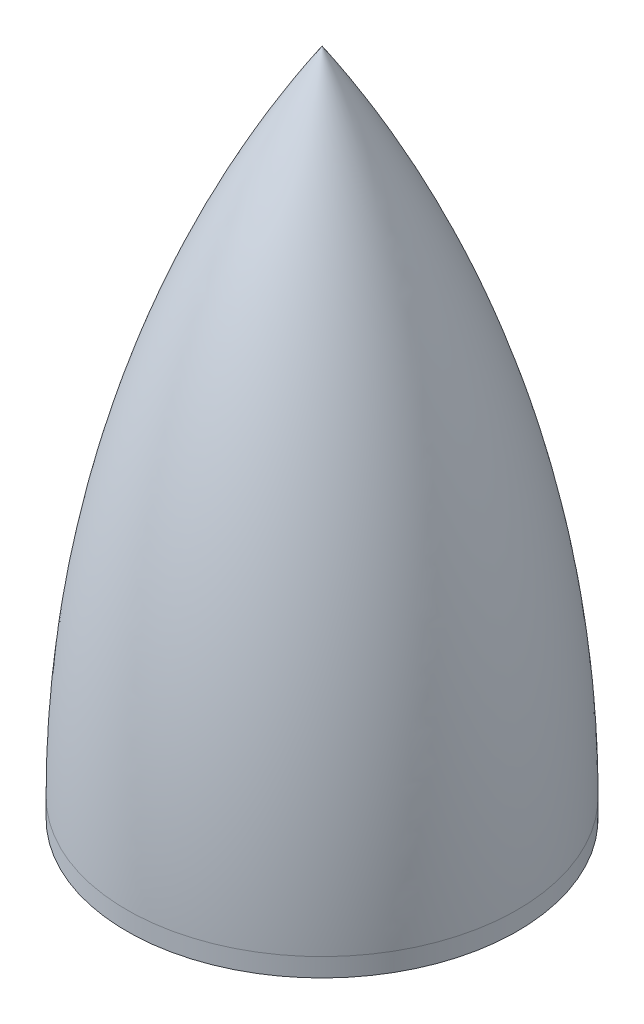
ISO-10303-21;
HEADER;
FILE_DESCRIPTION(('STEP AP214'),'2;1');
FILE_NAME('part.step','',(''),(''),'','','');
FILE_SCHEMA(('AUTOMOTIVE_DESIGN { 1 0 10303 214 1 1 1 1 }'));
ENDSEC;
DATA;
#1=APPLICATION_CONTEXT('core data for automotive mechanical design processes');
#2=APPLICATION_PROTOCOL_DEFINITION('international standard','automotive_design',2000,#1);
#3=PRODUCT_CONTEXT('',#1,'mechanical');
#4=PRODUCT('Part','Part','',(#3));
#5=PRODUCT_RELATED_PRODUCT_CATEGORY('part','',(#4));
#6=PRODUCT_DEFINITION_FORMATION('','',#4);
#7=PRODUCT_DEFINITION_CONTEXT('part definition',#1,'design');
#8=PRODUCT_DEFINITION('design','',#6,#7);
#9=PRODUCT_DEFINITION_SHAPE('','',#8);
#10=(LENGTH_UNIT() NAMED_UNIT(*) SI_UNIT(.MILLI.,.METRE.));
#11=(NAMED_UNIT(*) PLANE_ANGLE_UNIT() SI_UNIT($,.RADIAN.));
#12=(NAMED_UNIT(*) SI_UNIT($,.STERADIAN.) SOLID_ANGLE_UNIT());
#13=UNCERTAINTY_MEASURE_WITH_UNIT(LENGTH_MEASURE(1.E-05),#10,'distance_accuracy_value','');
#14=(GEOMETRIC_REPRESENTATION_CONTEXT(3) GLOBAL_UNCERTAINTY_ASSIGNED_CONTEXT((#13)) GLOBAL_UNIT_ASSIGNED_CONTEXT((#10,
#11,#12)) REPRESENTATION_CONTEXT('',''));
#15=CARTESIAN_POINT('',(0.,0.,0.));
#16=DIRECTION('',(0.,0.,1.));
#17=DIRECTION('',(1.,0.,0.));
#18=AXIS2_PLACEMENT_3D('',#15,#16,#17);
#19=CARTESIAN_POINT('',(0.,0.,0.));
#20=DIRECTION('',(0.,-1.,0.));
#21=DIRECTION('',(0.,0.,-1.));
#22=AXIS2_PLACEMENT_3D('',#19,#20,#21);
#23=CYLINDRICAL_SURFACE('',#22,22.225);
#24=CARTESIAN_POINT('',(0.,0.,0.));
#25=DIRECTION('',(0.,-1.,0.));
#26=DIRECTION('',(0.,0.,-1.));
#27=AXIS2_PLACEMENT_3D('',#24,#25,#26);
#28=CIRCLE('',#27,22.225);
#29=CARTESIAN_POINT('',(0.,0.,-22.225));
#30=VERTEX_POINT('',#29);
#31=EDGE_CURVE('E66',#30,#30,#28,.T.);
#32=ORIENTED_EDGE('',*,*,#31,.F.);
#33=EDGE_LOOP('',(#32));
#34=FACE_BOUND('',#33,.T.);
#35=CARTESIAN_POINT('',(0.,2.10820000000002,0.));
#36=DIRECTION('',(0.,-1.,0.));
#37=DIRECTION('',(0.,0.,-1.));
#38=AXIS2_PLACEMENT_3D('',#35,#36,#37);
#39=CIRCLE('',#38,22.225);
#40=CARTESIAN_POINT('',(0.,2.10820000000002,-22.225));
#41=VERTEX_POINT('',#40);
#42=EDGE_CURVE('E11',#41,#41,#39,.T.);
#43=ORIENTED_EDGE('',*,*,#42,.T.);
#44=EDGE_LOOP('',(#43));
#45=FACE_BOUND('',#44,.T.);
#46=ADVANCED_FACE('F31',(#34,#45),#23,.T.);
#47=CARTESIAN_POINT('',(0.,2.10820000000002,112.387946057143));
#48=DIRECTION('',(-1.,0.,0.));
#49=DIRECTION('',(0.,0.,-1.));
#50=AXIS2_PLACEMENT_3D('',#47,#48,#49);
#51=CIRCLE('',#50,134.612946057143);
#52=TRIMMED_CURVE('',#51,(PARAMETER_VALUE(-0.58285068598359)),
(PARAMETER_VALUE(0.58285068598359)),.T.,.PARAMETER.);
#53=CARTESIAN_POINT('',(0.,2.10820000000002,0.));
#54=DIRECTION('',(0.,-1.,0.));
#55=AXIS1_PLACEMENT('',#53,#54);
#56=SURFACE_OF_REVOLUTION('',#52,#55);
#57=ORIENTED_EDGE('',*,*,#42,.F.);
#58=EDGE_LOOP('',(#57));
#59=FACE_BOUND('',#58,.T.);
#60=CARTESIAN_POINT('',(0.,76.2,0.));
#61=VERTEX_POINT('',#60);
#62=VERTEX_LOOP('',#61);
#63=FACE_BOUND('',#62,.T.);
#64=ADVANCED_FACE('F48',(#59,#63),#56,.T.);
#65=CARTESIAN_POINT('',(0.,1.35439926698562,113.427235487483));
#66=DIRECTION('',(-1.,0.,0.));
#67=DIRECTION('',(0.,0.,-1.));
#68=AXIS2_PLACEMENT_3D('',#65,#66,#67);
#69=CIRCLE('',#68,134.612946057143);
#70=TRIMMED_CURVE('',#69,(PARAMETER_VALUE(-0.568670661398553)),
(PARAMETER_VALUE(0.568670661398553)),.T.,.PARAMETER.);
#71=CARTESIAN_POINT('',(0.,1.35439926698562,0.));
#72=DIRECTION('',(0.,-1.,0.));
#73=AXIS1_PLACEMENT('',#71,#72);
#74=SURFACE_OF_REVOLUTION('',#70,#73);
#75=CARTESIAN_POINT('',(0.,73.8451400264121,0.));
#76=VERTEX_POINT('',#75);
#77=VERTEX_LOOP('',#76);
#78=FACE_BOUND('',#77,.T.);
#79=CARTESIAN_POINT('',(0.,2.1082,0.));
#80=DIRECTION('',(0.,-1.,0.));
#81=DIRECTION('',(0.,0.,-1.));
#82=AXIS2_PLACEMENT_3D('',#79,#80,#81);
#83=CIRCLE('',#82,21.1836);
#84=CARTESIAN_POINT('',(0.,2.1082,-21.1836));
#85=VERTEX_POINT('',#84);
#86=EDGE_CURVE('E38',#85,#85,#83,.T.);
#87=ORIENTED_EDGE('',*,*,#86,.T.);
#88=EDGE_LOOP('',(#87));
#89=FACE_BOUND('',#88,.T.);
#90=ADVANCED_FACE('F44',(#78,#89),#74,.F.);
#91=CARTESIAN_POINT('',(6.35,2.1082,0.));
#92=DIRECTION('',(0.,-1.,0.));
#93=DIRECTION('',(0.,0.,-1.));
#94=AXIS2_PLACEMENT_3D('',#91,#92,#93);
#95=PLANE('',#94);
#96=ORIENTED_EDGE('',*,*,#86,.F.);
#97=EDGE_LOOP('',(#96));
#98=FACE_BOUND('',#97,.T.);
#99=CARTESIAN_POINT('',(0.,2.1082,0.));
#100=DIRECTION('',(0.,-1.,0.));
#101=DIRECTION('',(0.,0.,-1.));
#102=AXIS2_PLACEMENT_3D('',#99,#100,#101);
#103=CIRCLE('',#102,6.35);
#104=CARTESIAN_POINT('',(0.,2.1082,-6.35));
#105=VERTEX_POINT('',#104);
#106=EDGE_CURVE('E53',#105,#105,#103,.T.);
#107=ORIENTED_EDGE('',*,*,#106,.T.);
#108=EDGE_LOOP('',(#107));
#109=FACE_BOUND('',#108,.T.);
#110=ADVANCED_FACE('F47',(#98,#109),#95,.F.);
#111=CARTESIAN_POINT('',(0.,0.,0.));
#112=DIRECTION('',(0.,-1.,0.));
#113=DIRECTION('',(0.,0.,-1.));
#114=AXIS2_PLACEMENT_3D('',#111,#112,#113);
#115=CYLINDRICAL_SURFACE('',#114,6.35);
#116=ORIENTED_EDGE('',*,*,#106,.F.);
#117=EDGE_LOOP('',(#116));
#118=FACE_BOUND('',#117,.T.);
#119=CARTESIAN_POINT('',(0.,6.35,0.));
#120=DIRECTION('',(0.,-1.,0.));
#121=DIRECTION('',(0.,0.,-1.));
#122=AXIS2_PLACEMENT_3D('',#119,#120,#121);
#123=CIRCLE('',#122,6.35);
#124=CARTESIAN_POINT('',(0.,6.35,-6.35));
#125=VERTEX_POINT('',#124);
#126=EDGE_CURVE('E55',#125,#125,#123,.T.);
#127=ORIENTED_EDGE('',*,*,#126,.T.);
#128=EDGE_LOOP('',(#127));
#129=FACE_BOUND('',#128,.T.);
#130=ADVANCED_FACE('F82',(#118,#129),#115,.T.);
#131=CARTESIAN_POINT('',(1.5875,6.35,0.));
#132=DIRECTION('',(0.,-1.,0.));
#133=DIRECTION('',(0.,0.,-1.));
#134=AXIS2_PLACEMENT_3D('',#131,#132,#133);
#135=PLANE('',#134);
#136=ORIENTED_EDGE('',*,*,#126,.F.);
#137=EDGE_LOOP('',(#136));
#138=FACE_BOUND('',#137,.T.);
#139=CARTESIAN_POINT('',(0.,6.35,0.));
#140=DIRECTION('',(0.,-1.,0.));
#141=DIRECTION('',(0.,0.,-1.));
#142=AXIS2_PLACEMENT_3D('',#139,#140,#141);
#143=CIRCLE('',#142,1.5875);
#144=CARTESIAN_POINT('',(0.,6.35,-1.5875));
#145=VERTEX_POINT('',#144);
#146=EDGE_CURVE('E60',#145,#145,#143,.T.);
#147=ORIENTED_EDGE('',*,*,#146,.T.);
#148=EDGE_LOOP('',(#147));
#149=FACE_BOUND('',#148,.T.);
#150=ADVANCED_FACE('F85',(#138,#149),#135,.F.);
#151=CARTESIAN_POINT('',(0.,0.,0.));
#152=DIRECTION('',(0.,-1.,0.));
#153=DIRECTION('',(0.,0.,-1.));
#154=AXIS2_PLACEMENT_3D('',#151,#152,#153);
#155=CYLINDRICAL_SURFACE('',#154,1.5875);
#156=ORIENTED_EDGE('',*,*,#146,.F.);
#157=EDGE_LOOP('',(#156));
#158=FACE_BOUND('',#157,.T.);
#159=CARTESIAN_POINT('',(0.,0.,0.));
#160=DIRECTION('',(0.,-1.,0.));
#161=DIRECTION('',(0.,0.,-1.));
#162=AXIS2_PLACEMENT_3D('',#159,#160,#161);
#163=CIRCLE('',#162,1.5875);
#164=CARTESIAN_POINT('',(0.,0.,-1.5875));
#165=VERTEX_POINT('',#164);
#166=EDGE_CURVE('E63',#165,#165,#163,.T.);
#167=ORIENTED_EDGE('',*,*,#166,.T.);
#168=EDGE_LOOP('',(#167));
#169=FACE_BOUND('',#168,.T.);
#170=ADVANCED_FACE('F89',(#158,#169),#155,.F.);
#171=CARTESIAN_POINT('',(1.5875,0.,0.));
#172=DIRECTION('',(0.,1.,0.));
#173=DIRECTION('',(0.,0.,1.));
#174=AXIS2_PLACEMENT_3D('',#171,#172,#173);
#175=PLANE('',#174);
#176=ORIENTED_EDGE('',*,*,#166,.F.);
#177=EDGE_LOOP('',(#176));
#178=FACE_BOUND('',#177,.T.);
#179=ORIENTED_EDGE('',*,*,#31,.T.);
#180=EDGE_LOOP('',(#179));
#181=FACE_BOUND('',#180,.T.);
#182=ADVANCED_FACE('F70',(#178,#181),#175,.F.);
#183=CLOSED_SHELL('',(#46,#64,#90,#110,#130,#150,#170,#182));
#184=MANIFOLD_SOLID_BREP('B2',#183);
#185=ADVANCED_BREP_SHAPE_REPRESENTATION('',(#18,#184),#14);
#186=SHAPE_DEFINITION_REPRESENTATION(#9,#185);
ENDSEC;
END-ISO-10303-21;
